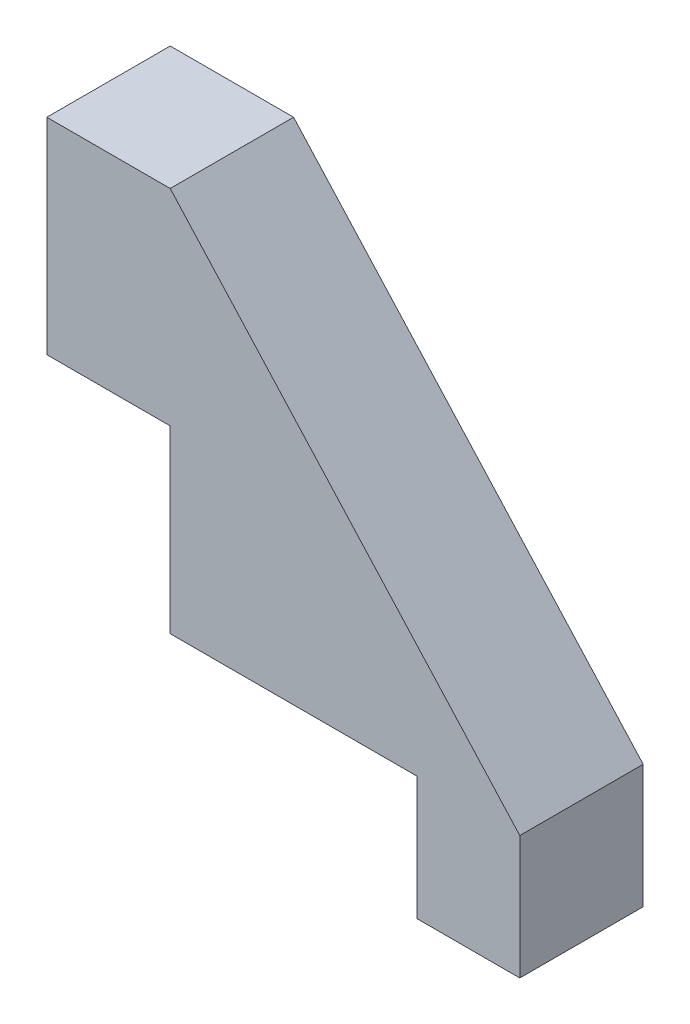
ISO-10303-21;
HEADER;
FILE_DESCRIPTION(('STEP AP214'),'2;1');
FILE_NAME('part.step','',(''),(''),'','','');
FILE_SCHEMA(('AUTOMOTIVE_DESIGN { 1 0 10303 214 1 1 1 1 }'));
ENDSEC;
DATA;
#1=APPLICATION_CONTEXT('core data for automotive mechanical design processes');
#2=APPLICATION_PROTOCOL_DEFINITION('international standard','automotive_design',2000,#1);
#3=PRODUCT_CONTEXT('',#1,'mechanical');
#4=PRODUCT('Part','Part','',(#3));
#5=PRODUCT_RELATED_PRODUCT_CATEGORY('part','',(#4));
#6=PRODUCT_DEFINITION_FORMATION('','',#4);
#7=PRODUCT_DEFINITION_CONTEXT('part definition',#1,'design');
#8=PRODUCT_DEFINITION('design','',#6,#7);
#9=PRODUCT_DEFINITION_SHAPE('','',#8);
#10=(LENGTH_UNIT() NAMED_UNIT(*) SI_UNIT(.MILLI.,.METRE.));
#11=(NAMED_UNIT(*) PLANE_ANGLE_UNIT() SI_UNIT($,.RADIAN.));
#12=(NAMED_UNIT(*) SI_UNIT($,.STERADIAN.) SOLID_ANGLE_UNIT());
#13=UNCERTAINTY_MEASURE_WITH_UNIT(LENGTH_MEASURE(1.E-05),#10,'distance_accuracy_value','');
#14=(GEOMETRIC_REPRESENTATION_CONTEXT(3) GLOBAL_UNCERTAINTY_ASSIGNED_CONTEXT((#13)) GLOBAL_UNIT_ASSIGNED_CONTEXT((#10,
#11,#12)) REPRESENTATION_CONTEXT('',''));
#15=CARTESIAN_POINT('',(0.,0.,0.));
#16=DIRECTION('',(0.,0.,1.));
#17=DIRECTION('',(1.,0.,0.));
#18=AXIS2_PLACEMENT_3D('',#15,#16,#17);
#19=CARTESIAN_POINT('',(12.,0.,6.));
#20=DIRECTION('',(0.,1.,0.));
#21=DIRECTION('',(-1.,0.,0.));
#22=AXIS2_PLACEMENT_3D('',#19,#20,#21);
#23=PLANE('',#22);
#24=DIRECTION('',(1.,0.,0.));
#25=VECTOR('',#24,1.);
#26=CARTESIAN_POINT('',(12.,0.,0.));
#27=LINE('',#26,#25);
#28=CARTESIAN_POINT('',(0.,0.,0.));
#29=VERTEX_POINT('',#28);
#30=CARTESIAN_POINT('',(12.,0.,0.));
#31=VERTEX_POINT('',#30);
#32=EDGE_CURVE('E136',#29,#31,#27,.T.);
#33=ORIENTED_EDGE('',*,*,#32,.T.);
#34=DIRECTION('',(0.,0.,-1.));
#35=VECTOR('',#34,1.);
#36=CARTESIAN_POINT('',(12.,0.,6.));
#37=LINE('',#36,#35);
#38=CARTESIAN_POINT('',(12.,0.,6.));
#39=VERTEX_POINT('',#38);
#40=EDGE_CURVE('E11',#39,#31,#37,.T.);
#41=ORIENTED_EDGE('',*,*,#40,.F.);
#42=DIRECTION('',(1.,0.,0.));
#43=VECTOR('',#42,1.);
#44=CARTESIAN_POINT('',(12.,0.,6.));
#45=LINE('',#44,#43);
#46=CARTESIAN_POINT('',(0.,0.,6.));
#47=VERTEX_POINT('',#46);
#48=EDGE_CURVE('E152',#47,#39,#45,.T.);
#49=ORIENTED_EDGE('',*,*,#48,.F.);
#50=DIRECTION('',(0.,0.,-1.));
#51=VECTOR('',#50,1.);
#52=CARTESIAN_POINT('',(0.,0.,6.));
#53=LINE('',#52,#51);
#54=EDGE_CURVE('E132',#47,#29,#53,.T.);
#55=ORIENTED_EDGE('',*,*,#54,.T.);
#56=EDGE_LOOP('',(#33,#41,#49,#55));
#57=FACE_BOUND('',#56,.T.);
#58=ADVANCED_FACE('F34',(#57),#23,.F.);
#59=CARTESIAN_POINT('',(12.,0.,6.));
#60=DIRECTION('',(1.,0.,0.));
#61=DIRECTION('',(0.,1.,0.));
#62=AXIS2_PLACEMENT_3D('',#59,#60,#61);
#63=PLANE('',#62);
#64=DIRECTION('',(0.,-1.,0.));
#65=VECTOR('',#64,1.);
#66=CARTESIAN_POINT('',(12.,0.,0.));
#67=LINE('',#66,#65);
#68=CARTESIAN_POINT('',(12.,-6.,0.));
#69=VERTEX_POINT('',#68);
#70=EDGE_CURVE('E139',#31,#69,#67,.T.);
#71=ORIENTED_EDGE('',*,*,#70,.T.);
#72=DIRECTION('',(0.,0.,-1.));
#73=VECTOR('',#72,1.);
#74=CARTESIAN_POINT('',(12.,-6.,6.));
#75=LINE('',#74,#73);
#76=CARTESIAN_POINT('',(12.,-6.,6.));
#77=VERTEX_POINT('',#76);
#78=EDGE_CURVE('E42',#77,#69,#75,.T.);
#79=ORIENTED_EDGE('',*,*,#78,.F.);
#80=DIRECTION('',(0.,-1.,0.));
#81=VECTOR('',#80,1.);
#82=CARTESIAN_POINT('',(12.,0.,6.));
#83=LINE('',#82,#81);
#84=EDGE_CURVE('E96',#39,#77,#83,.T.);
#85=ORIENTED_EDGE('',*,*,#84,.F.);
#86=ORIENTED_EDGE('',*,*,#40,.T.);
#87=EDGE_LOOP('',(#71,#79,#85,#86));
#88=FACE_BOUND('',#87,.T.);
#89=ADVANCED_FACE('F195',(#88),#63,.F.);
#90=CARTESIAN_POINT('',(17.,-6.,6.));
#91=DIRECTION('',(0.,1.,0.));
#92=DIRECTION('',(-1.,0.,0.));
#93=AXIS2_PLACEMENT_3D('',#90,#91,#92);
#94=PLANE('',#93);
#95=DIRECTION('',(1.,0.,0.));
#96=VECTOR('',#95,1.);
#97=CARTESIAN_POINT('',(17.,-6.,0.));
#98=LINE('',#97,#96);
#99=CARTESIAN_POINT('',(17.,-6.,0.));
#100=VERTEX_POINT('',#99);
#101=EDGE_CURVE('E141',#69,#100,#98,.T.);
#102=ORIENTED_EDGE('',*,*,#101,.T.);
#103=DIRECTION('',(0.,0.,-1.));
#104=VECTOR('',#103,1.);
#105=CARTESIAN_POINT('',(17.,-6.,6.));
#106=LINE('',#105,#104);
#107=CARTESIAN_POINT('',(17.,-6.,6.));
#108=VERTEX_POINT('',#107);
#109=EDGE_CURVE('E162',#108,#100,#106,.T.);
#110=ORIENTED_EDGE('',*,*,#109,.F.);
#111=DIRECTION('',(1.,0.,0.));
#112=VECTOR('',#111,1.);
#113=CARTESIAN_POINT('',(17.,-6.,6.));
#114=LINE('',#113,#112);
#115=EDGE_CURVE('E170',#77,#108,#114,.T.);
#116=ORIENTED_EDGE('',*,*,#115,.F.);
#117=ORIENTED_EDGE('',*,*,#78,.T.);
#118=EDGE_LOOP('',(#102,#110,#116,#117));
#119=FACE_BOUND('',#118,.T.);
#120=ADVANCED_FACE('F168',(#119),#94,.F.);
#121=CARTESIAN_POINT('',(17.,0.,6.));
#122=DIRECTION('',(-1.,0.,0.));
#123=DIRECTION('',(0.,-1.,0.));
#124=AXIS2_PLACEMENT_3D('',#121,#122,#123);
#125=PLANE('',#124);
#126=DIRECTION('',(0.,1.,0.));
#127=VECTOR('',#126,1.);
#128=CARTESIAN_POINT('',(17.,0.,0.));
#129=LINE('',#128,#127);
#130=CARTESIAN_POINT('',(17.,0.,0.));
#131=VERTEX_POINT('',#130);
#132=EDGE_CURVE('E143',#100,#131,#129,.T.);
#133=ORIENTED_EDGE('',*,*,#132,.T.);
#134=DIRECTION('',(0.,0.,-1.));
#135=VECTOR('',#134,1.);
#136=CARTESIAN_POINT('',(17.,0.,6.));
#137=LINE('',#136,#135);
#138=CARTESIAN_POINT('',(17.,0.,6.));
#139=VERTEX_POINT('',#138);
#140=EDGE_CURVE('E159',#139,#131,#137,.T.);
#141=ORIENTED_EDGE('',*,*,#140,.F.);
#142=DIRECTION('',(0.,1.,0.));
#143=VECTOR('',#142,1.);
#144=CARTESIAN_POINT('',(17.,0.,6.));
#145=LINE('',#144,#143);
#146=EDGE_CURVE('E186',#108,#139,#145,.T.);
#147=ORIENTED_EDGE('',*,*,#146,.F.);
#148=ORIENTED_EDGE('',*,*,#109,.T.);
#149=EDGE_LOOP('',(#133,#141,#147,#148));
#150=FACE_BOUND('',#149,.T.);
#151=ADVANCED_FACE('F179',(#150),#125,.F.);
#152=CARTESIAN_POINT('',(0.,18.75,6.));
#153=DIRECTION('',(-0.740833336580195,-0.671688891832711,0.));
#154=DIRECTION('',(0.671688891832711,-0.740833336580195,0.));
#155=AXIS2_PLACEMENT_3D('',#152,#153,#154);
#156=PLANE('',#155);
#157=DIRECTION('',(-0.671688891832711,0.740833336580195,0.));
#158=VECTOR('',#157,1.);
#159=CARTESIAN_POINT('',(0.,18.75,0.));
#160=LINE('',#159,#158);
#161=CARTESIAN_POINT('',(0.,18.75,0.));
#162=VERTEX_POINT('',#161);
#163=EDGE_CURVE('E145',#131,#162,#160,.T.);
#164=ORIENTED_EDGE('',*,*,#163,.T.);
#165=DIRECTION('',(0.,0.,-1.));
#166=VECTOR('',#165,1.);
#167=CARTESIAN_POINT('',(0.,18.75,6.));
#168=LINE('',#167,#166);
#169=CARTESIAN_POINT('',(0.,18.75,6.));
#170=VERTEX_POINT('',#169);
#171=EDGE_CURVE('E156',#170,#162,#168,.T.);
#172=ORIENTED_EDGE('',*,*,#171,.F.);
#173=DIRECTION('',(-0.671688891832711,0.740833336580195,0.));
#174=VECTOR('',#173,1.);
#175=CARTESIAN_POINT('',(0.,18.75,6.));
#176=LINE('',#175,#174);
#177=EDGE_CURVE('E185',#139,#170,#176,.T.);
#178=ORIENTED_EDGE('',*,*,#177,.F.);
#179=ORIENTED_EDGE('',*,*,#140,.T.);
#180=EDGE_LOOP('',(#164,#172,#178,#179));
#181=FACE_BOUND('',#180,.T.);
#182=ADVANCED_FACE('F183',(#181),#156,.F.);
#183=CARTESIAN_POINT('',(0.,18.75,6.));
#184=DIRECTION('',(0.,-1.,0.));
#185=DIRECTION('',(0.,0.,-1.));
#186=AXIS2_PLACEMENT_3D('',#183,#184,#185);
#187=PLANE('',#186);
#188=DIRECTION('',(-1.,0.,0.));
#189=VECTOR('',#188,1.);
#190=CARTESIAN_POINT('',(0.,18.75,0.));
#191=LINE('',#190,#189);
#192=CARTESIAN_POINT('',(-6.,18.75,0.));
#193=VERTEX_POINT('',#192);
#194=EDGE_CURVE('E147',#162,#193,#191,.T.);
#195=ORIENTED_EDGE('',*,*,#194,.T.);
#196=DIRECTION('',(0.,0.,-1.));
#197=VECTOR('',#196,1.);
#198=CARTESIAN_POINT('',(-6.,18.75,6.));
#199=LINE('',#198,#197);
#200=CARTESIAN_POINT('',(-6.,18.75,6.));
#201=VERTEX_POINT('',#200);
#202=EDGE_CURVE('E127',#201,#193,#199,.T.);
#203=ORIENTED_EDGE('',*,*,#202,.F.);
#204=DIRECTION('',(-1.,0.,0.));
#205=VECTOR('',#204,1.);
#206=CARTESIAN_POINT('',(0.,18.75,6.));
#207=LINE('',#206,#205);
#208=EDGE_CURVE('E118',#170,#201,#207,.T.);
#209=ORIENTED_EDGE('',*,*,#208,.F.);
#210=ORIENTED_EDGE('',*,*,#171,.T.);
#211=EDGE_LOOP('',(#195,#203,#209,#210));
#212=FACE_BOUND('',#211,.T.);
#213=ADVANCED_FACE('F207',(#212),#187,.F.);
#214=CARTESIAN_POINT('',(-6.,18.75,6.));
#215=DIRECTION('',(1.,0.,0.));
#216=DIRECTION('',(0.,1.,0.));
#217=AXIS2_PLACEMENT_3D('',#214,#215,#216);
#218=PLANE('',#217);
#219=DIRECTION('',(0.,-1.,0.));
#220=VECTOR('',#219,1.);
#221=CARTESIAN_POINT('',(-6.,18.75,0.));
#222=LINE('',#221,#220);
#223=CARTESIAN_POINT('',(-6.,8.75,0.));
#224=VERTEX_POINT('',#223);
#225=EDGE_CURVE('E126',#193,#224,#222,.T.);
#226=ORIENTED_EDGE('',*,*,#225,.T.);
#227=DIRECTION('',(0.,0.,-1.));
#228=VECTOR('',#227,1.);
#229=CARTESIAN_POINT('',(-6.,8.75,6.));
#230=LINE('',#229,#228);
#231=CARTESIAN_POINT('',(-6.,8.75,6.));
#232=VERTEX_POINT('',#231);
#233=EDGE_CURVE('E123',#232,#224,#230,.T.);
#234=ORIENTED_EDGE('',*,*,#233,.F.);
#235=DIRECTION('',(0.,-1.,0.));
#236=VECTOR('',#235,1.);
#237=CARTESIAN_POINT('',(-6.,18.75,6.));
#238=LINE('',#237,#236);
#239=EDGE_CURVE('E112',#201,#232,#238,.T.);
#240=ORIENTED_EDGE('',*,*,#239,.F.);
#241=ORIENTED_EDGE('',*,*,#202,.T.);
#242=EDGE_LOOP('',(#226,#234,#240,#241));
#243=FACE_BOUND('',#242,.T.);
#244=ADVANCED_FACE('F124',(#243),#218,.F.);
#245=CARTESIAN_POINT('',(0.,8.75,6.));
#246=DIRECTION('',(0.,1.,0.));
#247=DIRECTION('',(0.,0.,1.));
#248=AXIS2_PLACEMENT_3D('',#245,#246,#247);
#249=PLANE('',#248);
#250=DIRECTION('',(1.,0.,0.));
#251=VECTOR('',#250,1.);
#252=CARTESIAN_POINT('',(0.,8.75,0.));
#253=LINE('',#252,#251);
#254=CARTESIAN_POINT('',(0.,8.75,0.));
#255=VERTEX_POINT('',#254);
#256=EDGE_CURVE('E82',#224,#255,#253,.T.);
#257=ORIENTED_EDGE('',*,*,#256,.T.);
#258=DIRECTION('',(0.,0.,-1.));
#259=VECTOR('',#258,1.);
#260=CARTESIAN_POINT('',(0.,8.75,6.));
#261=LINE('',#260,#259);
#262=CARTESIAN_POINT('',(0.,8.75,6.));
#263=VERTEX_POINT('',#262);
#264=EDGE_CURVE('E128',#263,#255,#261,.T.);
#265=ORIENTED_EDGE('',*,*,#264,.F.);
#266=DIRECTION('',(1.,0.,0.));
#267=VECTOR('',#266,1.);
#268=CARTESIAN_POINT('',(0.,8.75,6.));
#269=LINE('',#268,#267);
#270=EDGE_CURVE('E116',#232,#263,#269,.T.);
#271=ORIENTED_EDGE('',*,*,#270,.F.);
#272=ORIENTED_EDGE('',*,*,#233,.T.);
#273=EDGE_LOOP('',(#257,#265,#271,#272));
#274=FACE_BOUND('',#273,.T.);
#275=ADVANCED_FACE('F130',(#274),#249,.F.);
#276=CARTESIAN_POINT('',(0.,0.,6.));
#277=DIRECTION('',(1.,0.,0.));
#278=DIRECTION('',(0.,1.,0.));
#279=AXIS2_PLACEMENT_3D('',#276,#277,#278);
#280=PLANE('',#279);
#281=DIRECTION('',(0.,-1.,0.));
#282=VECTOR('',#281,1.);
#283=CARTESIAN_POINT('',(0.,0.,0.));
#284=LINE('',#283,#282);
#285=EDGE_CURVE('E88',#255,#29,#284,.T.);
#286=ORIENTED_EDGE('',*,*,#285,.T.);
#287=ORIENTED_EDGE('',*,*,#54,.F.);
#288=DIRECTION('',(0.,-1.,0.));
#289=VECTOR('',#288,1.);
#290=CARTESIAN_POINT('',(0.,0.,6.));
#291=LINE('',#290,#289);
#292=EDGE_CURVE('E50',#263,#47,#291,.T.);
#293=ORIENTED_EDGE('',*,*,#292,.F.);
#294=ORIENTED_EDGE('',*,*,#264,.T.);
#295=EDGE_LOOP('',(#286,#287,#293,#294));
#296=FACE_BOUND('',#295,.T.);
#297=ADVANCED_FACE('F215',(#296),#280,.F.);
#298=CARTESIAN_POINT('',(0.,0.,6.));
#299=DIRECTION('',(0.,0.,-1.));
#300=DIRECTION('',(-1.,0.,0.));
#301=AXIS2_PLACEMENT_3D('',#298,#299,#300);
#302=PLANE('',#301);
#303=ORIENTED_EDGE('',*,*,#48,.T.);
#304=ORIENTED_EDGE('',*,*,#84,.T.);
#305=ORIENTED_EDGE('',*,*,#115,.T.);
#306=ORIENTED_EDGE('',*,*,#146,.T.);
#307=ORIENTED_EDGE('',*,*,#177,.T.);
#308=ORIENTED_EDGE('',*,*,#208,.T.);
#309=ORIENTED_EDGE('',*,*,#239,.T.);
#310=ORIENTED_EDGE('',*,*,#270,.T.);
#311=ORIENTED_EDGE('',*,*,#292,.T.);
#312=EDGE_LOOP('',(#303,#304,#305,#306,#307,#308,#309,#310,#311));
#313=FACE_BOUND('',#312,.T.);
#314=ADVANCED_FACE('F114',(#313),#302,.F.);
#315=CARTESIAN_POINT('',(0.,0.,0.));
#316=DIRECTION('',(0.,0.,-1.));
#317=DIRECTION('',(-1.,0.,0.));
#318=AXIS2_PLACEMENT_3D('',#315,#316,#317);
#319=PLANE('',#318);
#320=ORIENTED_EDGE('',*,*,#32,.F.);
#321=ORIENTED_EDGE('',*,*,#285,.F.);
#322=ORIENTED_EDGE('',*,*,#256,.F.);
#323=ORIENTED_EDGE('',*,*,#225,.F.);
#324=ORIENTED_EDGE('',*,*,#194,.F.);
#325=ORIENTED_EDGE('',*,*,#163,.F.);
#326=ORIENTED_EDGE('',*,*,#132,.F.);
#327=ORIENTED_EDGE('',*,*,#101,.F.);
#328=ORIENTED_EDGE('',*,*,#70,.F.);
#329=EDGE_LOOP('',(#320,#321,#322,#323,#324,#325,#326,#327,#328));
#330=FACE_BOUND('',#329,.T.);
#331=ADVANCED_FACE('F174',(#330),#319,.T.);
#332=CLOSED_SHELL('',(#58,#89,#120,#151,#182,#213,#244,#275,#297,#314,#331));
#333=MANIFOLD_SOLID_BREP('B2',#332);
#334=ADVANCED_BREP_SHAPE_REPRESENTATION('',(#18,#333),#14);
#335=SHAPE_DEFINITION_REPRESENTATION(#9,#334);
ENDSEC;
END-ISO-10303-21;
